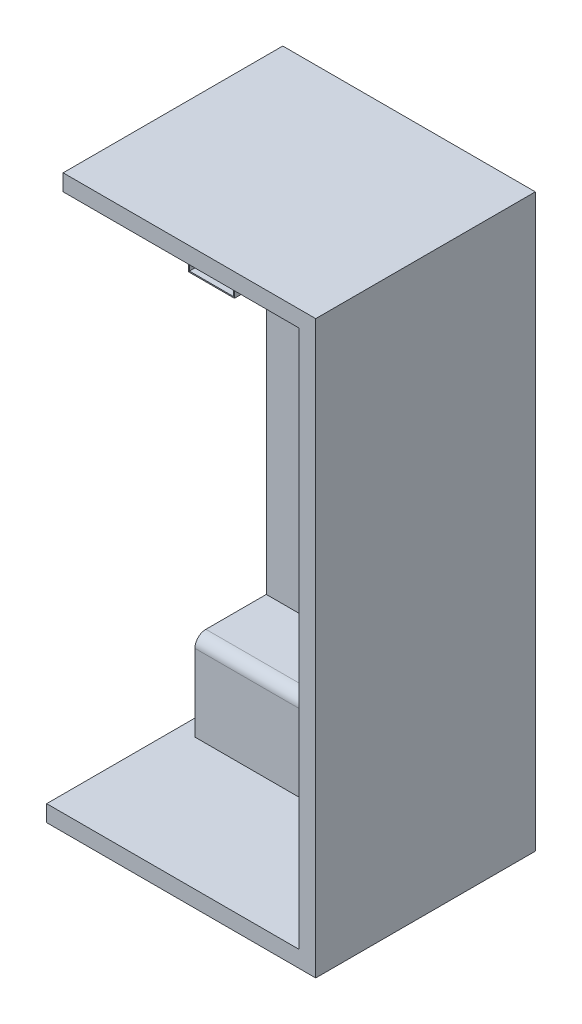
ISO-10303-21;
HEADER;
FILE_DESCRIPTION(('STEP AP214'),'2;1');
FILE_NAME('part.step','',(''),(''),'','','');
FILE_SCHEMA(('AUTOMOTIVE_DESIGN { 1 0 10303 214 1 1 1 1 }'));
ENDSEC;
DATA;
#1=APPLICATION_CONTEXT('core data for automotive mechanical design processes');
#2=APPLICATION_PROTOCOL_DEFINITION('international standard','automotive_design',2000,#1);
#3=PRODUCT_CONTEXT('',#1,'mechanical');
#4=PRODUCT('Part','Part','',(#3));
#5=PRODUCT_RELATED_PRODUCT_CATEGORY('part','',(#4));
#6=PRODUCT_DEFINITION_FORMATION('','',#4);
#7=PRODUCT_DEFINITION_CONTEXT('part definition',#1,'design');
#8=PRODUCT_DEFINITION('design','',#6,#7);
#9=PRODUCT_DEFINITION_SHAPE('','',#8);
#10=(LENGTH_UNIT() NAMED_UNIT(*) SI_UNIT(.MILLI.,.METRE.));
#11=(NAMED_UNIT(*) PLANE_ANGLE_UNIT() SI_UNIT($,.RADIAN.));
#12=(NAMED_UNIT(*) SI_UNIT($,.STERADIAN.) SOLID_ANGLE_UNIT());
#13=UNCERTAINTY_MEASURE_WITH_UNIT(LENGTH_MEASURE(1.E-05),#10,'distance_accuracy_value','');
#14=(GEOMETRIC_REPRESENTATION_CONTEXT(3) GLOBAL_UNCERTAINTY_ASSIGNED_CONTEXT((#13)) GLOBAL_UNIT_ASSIGNED_CONTEXT((#10,
#11,#12)) REPRESENTATION_CONTEXT('',''));
#15=CARTESIAN_POINT('',(0.,0.,0.));
#16=DIRECTION('',(0.,0.,1.));
#17=DIRECTION('',(1.,0.,0.));
#18=AXIS2_PLACEMENT_3D('',#15,#16,#17);
#19=CARTESIAN_POINT('',(-57.,492.,300.));
#20=DIRECTION('',(1.,0.,0.));
#21=DIRECTION('',(0.,1.,0.));
#22=AXIS2_PLACEMENT_3D('',#19,#20,#21);
#23=PLANE('',#22);
#24=DIRECTION('',(0.,-1.,0.));
#25=VECTOR('',#24,1.);
#26=CARTESIAN_POINT('',(-57.,408.,100.));
#27=LINE('',#26,#25);
#28=CARTESIAN_POINT('',(-57.,490.,100.));
#29=VERTEX_POINT('',#28);
#30=CARTESIAN_POINT('',(-57.,408.,100.));
#31=VERTEX_POINT('',#30);
#32=EDGE_CURVE('E173',#29,#31,#27,.T.);
#33=ORIENTED_EDGE('',*,*,#32,.T.);
#34=DIRECTION('',(0.,0.,-1.));
#35=VECTOR('',#34,1.);
#36=CARTESIAN_POINT('',(-57.,408.,300.));
#37=LINE('',#36,#35);
#38=CARTESIAN_POINT('',(-57.,408.,300.));
#39=VERTEX_POINT('',#38);
#40=EDGE_CURVE('E184',#39,#31,#37,.T.);
#41=ORIENTED_EDGE('',*,*,#40,.F.);
#42=DIRECTION('',(0.,-1.,0.));
#43=VECTOR('',#42,1.);
#44=CARTESIAN_POINT('',(-57.,492.,300.));
#45=LINE('',#44,#43);
#46=CARTESIAN_POINT('',(-57.,490.,300.));
#47=VERTEX_POINT('',#46);
#48=EDGE_CURVE('E348',#47,#39,#45,.T.);
#49=ORIENTED_EDGE('',*,*,#48,.F.);
#50=DIRECTION('',(0.,0.,1.));
#51=VECTOR('',#50,1.);
#52=CARTESIAN_POINT('',(-57.,490.,370.));
#53=LINE('',#52,#51);
#54=EDGE_CURVE('E47',#29,#47,#53,.T.);
#55=ORIENTED_EDGE('',*,*,#54,.F.);
#56=EDGE_LOOP('',(#33,#41,#49,#55));
#57=FACE_BOUND('',#56,.T.);
#58=ADVANCED_FACE('F32',(#57),#23,.F.);
#59=CARTESIAN_POINT('',(-57.,408.,300.));
#60=DIRECTION('',(0.,1.,0.));
#61=DIRECTION('',(0.,0.,1.));
#62=AXIS2_PLACEMENT_3D('',#59,#60,#61);
#63=PLANE('',#62);
#64=DIRECTION('',(1.,0.,0.));
#65=VECTOR('',#64,1.);
#66=CARTESIAN_POINT('',(-57.,408.,100.));
#67=LINE('',#66,#65);
#68=CARTESIAN_POINT('',(27.,408.,100.));
#69=VERTEX_POINT('',#68);
#70=EDGE_CURVE('E170',#31,#69,#67,.T.);
#71=ORIENTED_EDGE('',*,*,#70,.T.);
#72=DIRECTION('',(0.,0.,-1.));
#73=VECTOR('',#72,1.);
#74=CARTESIAN_POINT('',(27.,408.,300.));
#75=LINE('',#74,#73);
#76=CARTESIAN_POINT('',(27.,408.,300.));
#77=VERTEX_POINT('',#76);
#78=EDGE_CURVE('E190',#77,#69,#75,.T.);
#79=ORIENTED_EDGE('',*,*,#78,.F.);
#80=DIRECTION('',(1.,0.,0.));
#81=VECTOR('',#80,1.);
#82=CARTESIAN_POINT('',(-57.,408.,300.));
#83=LINE('',#82,#81);
#84=EDGE_CURVE('E188',#39,#77,#83,.T.);
#85=ORIENTED_EDGE('',*,*,#84,.F.);
#86=ORIENTED_EDGE('',*,*,#40,.T.);
#87=EDGE_LOOP('',(#71,#79,#85,#86));
#88=FACE_BOUND('',#87,.T.);
#89=ADVANCED_FACE('F187',(#88),#63,.F.);
#90=CARTESIAN_POINT('',(27.,492.,300.));
#91=DIRECTION('',(-1.,0.,0.));
#92=DIRECTION('',(0.,-1.,0.));
#93=AXIS2_PLACEMENT_3D('',#90,#91,#92);
#94=PLANE('',#93);
#95=DIRECTION('',(0.,1.,0.));
#96=VECTOR('',#95,1.);
#97=CARTESIAN_POINT('',(27.,408.,100.));
#98=LINE('',#97,#96);
#99=CARTESIAN_POINT('',(27.,490.,100.));
#100=VERTEX_POINT('',#99);
#101=EDGE_CURVE('E175',#69,#100,#98,.T.);
#102=ORIENTED_EDGE('',*,*,#101,.T.);
#103=DIRECTION('',(0.,0.,-1.));
#104=VECTOR('',#103,1.);
#105=CARTESIAN_POINT('',(27.,490.,370.));
#106=LINE('',#105,#104);
#107=CARTESIAN_POINT('',(27.,490.,300.));
#108=VERTEX_POINT('',#107);
#109=EDGE_CURVE('E317',#108,#100,#106,.T.);
#110=ORIENTED_EDGE('',*,*,#109,.F.);
#111=DIRECTION('',(0.,1.,0.));
#112=VECTOR('',#111,1.);
#113=CARTESIAN_POINT('',(27.,492.,300.));
#114=LINE('',#113,#112);
#115=EDGE_CURVE('E195',#77,#108,#114,.T.);
#116=ORIENTED_EDGE('',*,*,#115,.F.);
#117=ORIENTED_EDGE('',*,*,#78,.T.);
#118=EDGE_LOOP('',(#102,#110,#116,#117));
#119=FACE_BOUND('',#118,.T.);
#120=ADVANCED_FACE('F351',(#119),#94,.F.);
#121=CARTESIAN_POINT('',(-55.,490.,300.));
#122=DIRECTION('',(1.,0.,0.));
#123=DIRECTION('',(0.,1.,0.));
#124=AXIS2_PLACEMENT_3D('',#121,#122,#123);
#125=PLANE('',#124);
#126=DIRECTION('',(0.,0.,-1.));
#127=VECTOR('',#126,1.);
#128=CARTESIAN_POINT('',(-55.,410.,300.));
#129=LINE('',#128,#127);
#130=CARTESIAN_POINT('',(-55.,410.,300.));
#131=VERTEX_POINT('',#130);
#132=CARTESIAN_POINT('',(-55.,410.,100.));
#133=VERTEX_POINT('',#132);
#134=EDGE_CURVE('E345',#131,#133,#129,.T.);
#135=ORIENTED_EDGE('',*,*,#134,.T.);
#136=DIRECTION('',(0.,1.,0.));
#137=VECTOR('',#136,1.);
#138=CARTESIAN_POINT('',(-55.,490.,100.));
#139=LINE('',#138,#137);
#140=CARTESIAN_POINT('',(-55.,490.,100.));
#141=VERTEX_POINT('',#140);
#142=EDGE_CURVE('E359',#133,#141,#139,.T.);
#143=ORIENTED_EDGE('',*,*,#142,.T.);
#144=DIRECTION('',(0.,0.,-1.));
#145=VECTOR('',#144,1.);
#146=CARTESIAN_POINT('',(-55.,490.,300.));
#147=LINE('',#146,#145);
#148=CARTESIAN_POINT('',(-55.,490.,300.));
#149=VERTEX_POINT('',#148);
#150=EDGE_CURVE('E334',#149,#141,#147,.T.);
#151=ORIENTED_EDGE('',*,*,#150,.F.);
#152=DIRECTION('',(0.,-1.,0.));
#153=VECTOR('',#152,1.);
#154=CARTESIAN_POINT('',(-55.,490.,300.));
#155=LINE('',#154,#153);
#156=EDGE_CURVE('E339',#149,#131,#155,.T.);
#157=ORIENTED_EDGE('',*,*,#156,.T.);
#158=EDGE_LOOP('',(#135,#143,#151,#157));
#159=FACE_BOUND('',#158,.T.);
#160=ADVANCED_FACE('F368',(#159),#125,.T.);
#161=CARTESIAN_POINT('',(-55.,410.,300.));
#162=DIRECTION('',(0.,1.,0.));
#163=DIRECTION('',(0.,0.,1.));
#164=AXIS2_PLACEMENT_3D('',#161,#162,#163);
#165=PLANE('',#164);
#166=DIRECTION('',(0.,0.,-1.));
#167=VECTOR('',#166,1.);
#168=CARTESIAN_POINT('',(25.,410.,300.));
#169=LINE('',#168,#167);
#170=CARTESIAN_POINT('',(25.,410.,300.));
#171=VERTEX_POINT('',#170);
#172=CARTESIAN_POINT('',(25.,410.,100.));
#173=VERTEX_POINT('',#172);
#174=EDGE_CURVE('E333',#171,#173,#169,.T.);
#175=ORIENTED_EDGE('',*,*,#174,.T.);
#176=DIRECTION('',(-1.,0.,0.));
#177=VECTOR('',#176,1.);
#178=CARTESIAN_POINT('',(-55.,410.,100.));
#179=LINE('',#178,#177);
#180=EDGE_CURVE('E355',#173,#133,#179,.T.);
#181=ORIENTED_EDGE('',*,*,#180,.T.);
#182=ORIENTED_EDGE('',*,*,#134,.F.);
#183=DIRECTION('',(1.,0.,0.));
#184=VECTOR('',#183,1.);
#185=CARTESIAN_POINT('',(-55.,410.,300.));
#186=LINE('',#185,#184);
#187=EDGE_CURVE('E335',#131,#171,#186,.T.);
#188=ORIENTED_EDGE('',*,*,#187,.T.);
#189=EDGE_LOOP('',(#175,#181,#182,#188));
#190=FACE_BOUND('',#189,.T.);
#191=ADVANCED_FACE('F370',(#190),#165,.T.);
#192=CARTESIAN_POINT('',(25.,490.,300.));
#193=DIRECTION('',(-1.,0.,0.));
#194=DIRECTION('',(0.,-1.,0.));
#195=AXIS2_PLACEMENT_3D('',#192,#193,#194);
#196=PLANE('',#195);
#197=DIRECTION('',(0.,0.,-1.));
#198=VECTOR('',#197,1.);
#199=CARTESIAN_POINT('',(25.,490.,300.));
#200=LINE('',#199,#198);
#201=CARTESIAN_POINT('',(25.,490.,300.));
#202=VERTEX_POINT('',#201);
#203=CARTESIAN_POINT('',(25.,490.,100.));
#204=VERTEX_POINT('',#203);
#205=EDGE_CURVE('E331',#202,#204,#200,.T.);
#206=ORIENTED_EDGE('',*,*,#205,.T.);
#207=DIRECTION('',(0.,-1.,0.));
#208=VECTOR('',#207,1.);
#209=CARTESIAN_POINT('',(25.,490.,100.));
#210=LINE('',#209,#208);
#211=EDGE_CURVE('E11',#204,#173,#210,.T.);
#212=ORIENTED_EDGE('',*,*,#211,.T.);
#213=ORIENTED_EDGE('',*,*,#174,.F.);
#214=DIRECTION('',(0.,1.,0.));
#215=VECTOR('',#214,1.);
#216=CARTESIAN_POINT('',(25.,490.,300.));
#217=LINE('',#216,#215);
#218=EDGE_CURVE('E325',#171,#202,#217,.T.);
#219=ORIENTED_EDGE('',*,*,#218,.T.);
#220=EDGE_LOOP('',(#206,#212,#213,#219));
#221=FACE_BOUND('',#220,.T.);
#222=ADVANCED_FACE('F330',(#221),#196,.T.);
#223=CARTESIAN_POINT('',(215.,-490.,370.));
#224=DIRECTION('',(-1.,0.,0.));
#225=DIRECTION('',(0.,0.,1.));
#226=AXIS2_PLACEMENT_3D('',#223,#224,#225);
#227=PLANE('',#226);
#228=CARTESIAN_POINT('',(215.,-80.,160.000000000004));
#229=DIRECTION('',(-1.,0.,0.));
#230=DIRECTION('',(0.,0.,1.));
#231=AXIS2_PLACEMENT_3D('',#228,#229,#230);
#232=CIRCLE('',#231,2.99999999999999);
#233=CARTESIAN_POINT('',(215.,-80.,163.000000000004));
#234=VERTEX_POINT('',#233);
#235=EDGE_CURVE('E200',#234,#234,#232,.T.);
#236=ORIENTED_EDGE('',*,*,#235,.F.);
#237=EDGE_LOOP('',(#236));
#238=FACE_BOUND('',#237,.T.);
#239=CARTESIAN_POINT('',(215.,160.,160.000000000001));
#240=DIRECTION('',(-1.,0.,0.));
#241=DIRECTION('',(0.,0.,1.));
#242=AXIS2_PLACEMENT_3D('',#239,#240,#241);
#243=CIRCLE('',#242,2.99999999999999);
#244=CARTESIAN_POINT('',(215.,160.,163.000000000001));
#245=VERTEX_POINT('',#244);
#246=EDGE_CURVE('E211',#245,#245,#243,.T.);
#247=ORIENTED_EDGE('',*,*,#246,.F.);
#248=EDGE_LOOP('',(#247));
#249=FACE_BOUND('',#248,.T.);
#250=DIRECTION('',(0.,1.,0.));
#251=VECTOR('',#250,1.);
#252=CARTESIAN_POINT('',(215.,-490.,0.));
#253=LINE('',#252,#251);
#254=CARTESIAN_POINT('',(215.,-330.,0.));
#255=VERTEX_POINT('',#254);
#256=CARTESIAN_POINT('',(215.,490.,0.));
#257=VERTEX_POINT('',#256);
#258=EDGE_CURVE('E268',#255,#257,#253,.T.);
#259=ORIENTED_EDGE('',*,*,#258,.F.);
#260=DIRECTION('',(0.,0.,-1.));
#261=VECTOR('',#260,1.);
#262=CARTESIAN_POINT('',(215.,-330.,130.));
#263=LINE('',#262,#261);
#264=CARTESIAN_POINT('',(215.,-330.,110.));
#265=VERTEX_POINT('',#264);
#266=EDGE_CURVE('E255',#265,#255,#263,.T.);
#267=ORIENTED_EDGE('',*,*,#266,.F.);
#268=CARTESIAN_POINT('',(215.,-350.,110.));
#269=DIRECTION('',(-1.,0.,0.));
#270=DIRECTION('',(0.,0.,1.));
#271=AXIS2_PLACEMENT_3D('',#268,#269,#270);
#272=CIRCLE('',#271,20.);
#273=CARTESIAN_POINT('',(215.,-350.,130.));
#274=VERTEX_POINT('',#273);
#275=EDGE_CURVE('E315',#265,#274,#272,.F.);
#276=ORIENTED_EDGE('',*,*,#275,.T.);
#277=DIRECTION('',(0.,1.,0.));
#278=VECTOR('',#277,1.);
#279=CARTESIAN_POINT('',(215.,-490.,130.));
#280=LINE('',#279,#278);
#281=CARTESIAN_POINT('',(215.,-490.,130.));
#282=VERTEX_POINT('',#281);
#283=EDGE_CURVE('E248',#282,#274,#280,.T.);
#284=ORIENTED_EDGE('',*,*,#283,.F.);
#285=DIRECTION('',(0.,0.,-1.));
#286=VECTOR('',#285,1.);
#287=CARTESIAN_POINT('',(215.,-490.,370.));
#288=LINE('',#287,#286);
#289=CARTESIAN_POINT('',(215.,-490.,370.));
#290=VERTEX_POINT('',#289);
#291=EDGE_CURVE('E277',#290,#282,#288,.T.);
#292=ORIENTED_EDGE('',*,*,#291,.F.);
#293=DIRECTION('',(0.,1.,0.));
#294=VECTOR('',#293,1.);
#295=CARTESIAN_POINT('',(215.,-490.,370.));
#296=LINE('',#295,#294);
#297=CARTESIAN_POINT('',(215.,490.,370.));
#298=VERTEX_POINT('',#297);
#299=EDGE_CURVE('E269',#290,#298,#296,.T.);
#300=ORIENTED_EDGE('',*,*,#299,.T.);
#301=DIRECTION('',(0.,0.,-1.));
#302=VECTOR('',#301,1.);
#303=CARTESIAN_POINT('',(215.,490.,370.));
#304=LINE('',#303,#302);
#305=EDGE_CURVE('E288',#298,#257,#304,.T.);
#306=ORIENTED_EDGE('',*,*,#305,.T.);
#307=EDGE_LOOP('',(#259,#267,#276,#284,#292,#300,#306));
#308=FACE_BOUND('',#307,.T.);
#309=CARTESIAN_POINT('',(215.,280.,160.));
#310=DIRECTION('',(-1.,0.,0.));
#311=DIRECTION('',(0.,0.,1.));
#312=AXIS2_PLACEMENT_3D('',#309,#310,#311);
#313=CIRCLE('',#312,2.99999999999999);
#314=CARTESIAN_POINT('',(215.,280.,163.));
#315=VERTEX_POINT('',#314);
#316=EDGE_CURVE('E217',#315,#315,#313,.T.);
#317=ORIENTED_EDGE('',*,*,#316,.F.);
#318=EDGE_LOOP('',(#317));
#319=FACE_BOUND('',#318,.T.);
#320=CARTESIAN_POINT('',(215.,40.,160.000000000003));
#321=DIRECTION('',(-1.,0.,0.));
#322=DIRECTION('',(0.,0.,1.));
#323=AXIS2_PLACEMENT_3D('',#320,#321,#322);
#324=CIRCLE('',#323,2.99999999999999);
#325=CARTESIAN_POINT('',(215.,40.,163.000000000003));
#326=VERTEX_POINT('',#325);
#327=EDGE_CURVE('E205',#326,#326,#324,.T.);
#328=ORIENTED_EDGE('',*,*,#327,.F.);
#329=EDGE_LOOP('',(#328));
#330=FACE_BOUND('',#329,.T.);
#331=CARTESIAN_POINT('',(215.,-200.,160.000000000005));
#332=DIRECTION('',(-1.,0.,0.));
#333=DIRECTION('',(0.,0.,1.));
#334=AXIS2_PLACEMENT_3D('',#331,#332,#333);
#335=CIRCLE('',#334,2.99999999999999);
#336=CARTESIAN_POINT('',(215.,-200.,163.000000000005));
#337=VERTEX_POINT('',#336);
#338=EDGE_CURVE('E189',#337,#337,#335,.T.);
#339=ORIENTED_EDGE('',*,*,#338,.F.);
#340=EDGE_LOOP('',(#339));
#341=FACE_BOUND('',#340,.T.);
#342=ADVANCED_FACE('F407',(#238,#249,#308,#319,#330,#341),#227,.T.);
#343=CARTESIAN_POINT('',(-215.,-490.,370.));
#344=DIRECTION('',(0.,1.,0.));
#345=DIRECTION('',(0.,0.,1.));
#346=AXIS2_PLACEMENT_3D('',#343,#344,#345);
#347=PLANE('',#346);
#348=ORIENTED_EDGE('',*,*,#291,.T.);
#349=DIRECTION('',(1.,0.,0.));
#350=VECTOR('',#349,1.);
#351=CARTESIAN_POINT('',(-215.,-490.,130.));
#352=LINE('',#351,#350);
#353=CARTESIAN_POINT('',(-215.,-490.,130.));
#354=VERTEX_POINT('',#353);
#355=EDGE_CURVE('E245',#354,#282,#352,.T.);
#356=ORIENTED_EDGE('',*,*,#355,.F.);
#357=DIRECTION('',(0.,0.,1.));
#358=VECTOR('',#357,1.);
#359=CARTESIAN_POINT('',(-215.,-490.,-1040.44544632553));
#360=LINE('',#359,#358);
#361=CARTESIAN_POINT('',(-215.,-490.,-30.));
#362=VERTEX_POINT('',#361);
#363=EDGE_CURVE('E230',#362,#354,#360,.T.);
#364=ORIENTED_EDGE('',*,*,#363,.F.);
#365=DIRECTION('',(1.,0.,0.));
#366=VECTOR('',#365,1.);
#367=CARTESIAN_POINT('',(-245.,-490.,-30.));
#368=LINE('',#367,#366);
#369=CARTESIAN_POINT('',(-245.,-490.,-30.));
#370=VERTEX_POINT('',#369);
#371=EDGE_CURVE('E227',#370,#362,#368,.T.);
#372=ORIENTED_EDGE('',*,*,#371,.F.);
#373=DIRECTION('',(0.,0.,1.));
#374=VECTOR('',#373,1.);
#375=CARTESIAN_POINT('',(-245.,-490.,-1040.44544632553));
#376=LINE('',#375,#374);
#377=CARTESIAN_POINT('',(-245.,-490.,370.));
#378=VERTEX_POINT('',#377);
#379=EDGE_CURVE('E237',#370,#378,#376,.T.);
#380=ORIENTED_EDGE('',*,*,#379,.T.);
#381=DIRECTION('',(1.,0.,0.));
#382=VECTOR('',#381,1.);
#383=CARTESIAN_POINT('',(-215.,-490.,370.));
#384=LINE('',#383,#382);
#385=EDGE_CURVE('E275',#378,#290,#384,.T.);
#386=ORIENTED_EDGE('',*,*,#385,.T.);
#387=EDGE_LOOP('',(#348,#356,#364,#372,#380,#386));
#388=FACE_BOUND('',#387,.T.);
#389=ADVANCED_FACE('F397',(#388),#347,.T.);
#390=CARTESIAN_POINT('',(0.,0.,0.));
#391=DIRECTION('',(0.,0.,-1.));
#392=DIRECTION('',(-1.,0.,0.));
#393=AXIS2_PLACEMENT_3D('',#390,#391,#392);
#394=PLANE('',#393);
#395=DIRECTION('',(-1.,0.,0.));
#396=VECTOR('',#395,1.);
#397=CARTESIAN_POINT('',(-215.,490.,0.));
#398=LINE('',#397,#396);
#399=CARTESIAN_POINT('',(-215.,490.,0.));
#400=VERTEX_POINT('',#399);
#401=EDGE_CURVE('E279',#257,#400,#398,.T.);
#402=ORIENTED_EDGE('',*,*,#401,.T.);
#403=DIRECTION('',(0.,-1.,0.));
#404=VECTOR('',#403,1.);
#405=CARTESIAN_POINT('',(-215.,-490.,0.));
#406=LINE('',#405,#404);
#407=CARTESIAN_POINT('',(-215.,-330.,0.));
#408=VERTEX_POINT('',#407);
#409=EDGE_CURVE('E272',#400,#408,#406,.T.);
#410=ORIENTED_EDGE('',*,*,#409,.T.);
#411=DIRECTION('',(-1.,0.,0.));
#412=VECTOR('',#411,1.);
#413=CARTESIAN_POINT('',(-215.,-330.,0.));
#414=LINE('',#413,#412);
#415=EDGE_CURVE('E241',#255,#408,#414,.T.);
#416=ORIENTED_EDGE('',*,*,#415,.F.);
#417=ORIENTED_EDGE('',*,*,#258,.T.);
#418=EDGE_LOOP('',(#402,#410,#416,#417));
#419=FACE_BOUND('',#418,.T.);
#420=ADVANCED_FACE('F422',(#419),#394,.F.);
#421=CARTESIAN_POINT('',(0.,0.,370.));
#422=DIRECTION('',(0.,0.,1.));
#423=DIRECTION('',(1.,0.,0.));
#424=AXIS2_PLACEMENT_3D('',#421,#422,#423);
#425=PLANE('',#424);
#426=ORIENTED_EDGE('',*,*,#385,.F.);
#427=DIRECTION('',(0.,-1.,0.));
#428=VECTOR('',#427,1.);
#429=CARTESIAN_POINT('',(-245.,-520.,370.));
#430=LINE('',#429,#428);
#431=CARTESIAN_POINT('',(-245.,-520.,370.));
#432=VERTEX_POINT('',#431);
#433=EDGE_CURVE('E299',#378,#432,#430,.T.);
#434=ORIENTED_EDGE('',*,*,#433,.T.);
#435=DIRECTION('',(1.,0.,0.));
#436=VECTOR('',#435,1.);
#437=CARTESIAN_POINT('',(-245.,-520.,370.));
#438=LINE('',#437,#436);
#439=CARTESIAN_POINT('',(245.,-520.,370.));
#440=VERTEX_POINT('',#439);
#441=EDGE_CURVE('E291',#432,#440,#438,.T.);
#442=ORIENTED_EDGE('',*,*,#441,.T.);
#443=DIRECTION('',(0.,1.,0.));
#444=VECTOR('',#443,1.);
#445=CARTESIAN_POINT('',(245.,-520.,370.));
#446=LINE('',#445,#444);
#447=CARTESIAN_POINT('',(245.,520.,370.));
#448=VERTEX_POINT('',#447);
#449=EDGE_CURVE('E294',#440,#448,#446,.T.);
#450=ORIENTED_EDGE('',*,*,#449,.T.);
#451=DIRECTION('',(-1.,0.,0.));
#452=VECTOR('',#451,1.);
#453=CARTESIAN_POINT('',(-245.,520.,370.));
#454=LINE('',#453,#452);
#455=CARTESIAN_POINT('',(-215.,520.,370.));
#456=VERTEX_POINT('',#455);
#457=EDGE_CURVE('E296',#448,#456,#454,.T.);
#458=ORIENTED_EDGE('',*,*,#457,.T.);
#459=DIRECTION('',(0.,1.,0.));
#460=VECTOR('',#459,1.);
#461=CARTESIAN_POINT('',(-215.,520.,370.));
#462=LINE('',#461,#460);
#463=CARTESIAN_POINT('',(-215.,490.,370.));
#464=VERTEX_POINT('',#463);
#465=EDGE_CURVE('E223',#464,#456,#462,.T.);
#466=ORIENTED_EDGE('',*,*,#465,.F.);
#467=DIRECTION('',(-1.,0.,0.));
#468=VECTOR('',#467,1.);
#469=CARTESIAN_POINT('',(-215.,490.,370.));
#470=LINE('',#469,#468);
#471=EDGE_CURVE('E271',#298,#464,#470,.T.);
#472=ORIENTED_EDGE('',*,*,#471,.F.);
#473=ORIENTED_EDGE('',*,*,#299,.F.);
#474=EDGE_LOOP('',(#426,#434,#442,#450,#458,#466,#472,#473));
#475=FACE_BOUND('',#474,.T.);
#476=ADVANCED_FACE('F384',(#475),#425,.T.);
#477=CARTESIAN_POINT('',(-245.,-520.,370.));
#478=DIRECTION('',(0.,1.,0.));
#479=DIRECTION('',(0.,0.,1.));
#480=AXIS2_PLACEMENT_3D('',#477,#478,#479);
#481=PLANE('',#480);
#482=DIRECTION('',(0.,0.,-1.));
#483=VECTOR('',#482,1.);
#484=CARTESIAN_POINT('',(-245.,-520.,370.));
#485=LINE('',#484,#483);
#486=CARTESIAN_POINT('',(-245.,-520.,-30.));
#487=VERTEX_POINT('',#486);
#488=EDGE_CURVE('E301',#432,#487,#485,.T.);
#489=ORIENTED_EDGE('',*,*,#488,.T.);
#490=DIRECTION('',(-1.,0.,0.));
#491=VECTOR('',#490,1.);
#492=CARTESIAN_POINT('',(245.,-520.,-30.));
#493=LINE('',#492,#491);
#494=CARTESIAN_POINT('',(245.,-520.,-30.));
#495=VERTEX_POINT('',#494);
#496=EDGE_CURVE('E260',#495,#487,#493,.T.);
#497=ORIENTED_EDGE('',*,*,#496,.F.);
#498=DIRECTION('',(0.,0.,-1.));
#499=VECTOR('',#498,1.);
#500=CARTESIAN_POINT('',(245.,-520.,370.));
#501=LINE('',#500,#499);
#502=EDGE_CURVE('E306',#440,#495,#501,.T.);
#503=ORIENTED_EDGE('',*,*,#502,.F.);
#504=ORIENTED_EDGE('',*,*,#441,.F.);
#505=EDGE_LOOP('',(#489,#497,#503,#504));
#506=FACE_BOUND('',#505,.T.);
#507=ADVANCED_FACE('F429',(#506),#481,.F.);
#508=CARTESIAN_POINT('',(245.,-520.,370.));
#509=DIRECTION('',(-1.,0.,0.));
#510=DIRECTION('',(0.,0.,1.));
#511=AXIS2_PLACEMENT_3D('',#508,#509,#510);
#512=PLANE('',#511);
#513=ORIENTED_EDGE('',*,*,#502,.T.);
#514=DIRECTION('',(0.,-1.,0.));
#515=VECTOR('',#514,1.);
#516=CARTESIAN_POINT('',(245.,520.,-30.));
#517=LINE('',#516,#515);
#518=CARTESIAN_POINT('',(245.,520.,-30.));
#519=VERTEX_POINT('',#518);
#520=EDGE_CURVE('E257',#519,#495,#517,.T.);
#521=ORIENTED_EDGE('',*,*,#520,.F.);
#522=DIRECTION('',(0.,0.,-1.));
#523=VECTOR('',#522,1.);
#524=CARTESIAN_POINT('',(245.,520.,370.));
#525=LINE('',#524,#523);
#526=EDGE_CURVE('E303',#448,#519,#525,.T.);
#527=ORIENTED_EDGE('',*,*,#526,.F.);
#528=ORIENTED_EDGE('',*,*,#449,.F.);
#529=EDGE_LOOP('',(#513,#521,#527,#528));
#530=FACE_BOUND('',#529,.T.);
#531=ADVANCED_FACE('F633',(#530),#512,.F.);
#532=CARTESIAN_POINT('',(-245.,520.,370.));
#533=DIRECTION('',(0.,-1.,0.));
#534=DIRECTION('',(0.,0.,-1.));
#535=AXIS2_PLACEMENT_3D('',#532,#533,#534);
#536=PLANE('',#535);
#537=DIRECTION('',(1.,0.,0.));
#538=VECTOR('',#537,1.);
#539=CARTESIAN_POINT('',(245.,520.,-30.));
#540=LINE('',#539,#538);
#541=CARTESIAN_POINT('',(-215.,520.,-30.));
#542=VERTEX_POINT('',#541);
#543=EDGE_CURVE('E266',#542,#519,#540,.T.);
#544=ORIENTED_EDGE('',*,*,#543,.F.);
#545=DIRECTION('',(0.,0.,1.));
#546=VECTOR('',#545,1.);
#547=CARTESIAN_POINT('',(-215.,520.,-1040.44544632553));
#548=LINE('',#547,#546);
#549=EDGE_CURVE('E234',#542,#456,#548,.T.);
#550=ORIENTED_EDGE('',*,*,#549,.T.);
#551=ORIENTED_EDGE('',*,*,#457,.F.);
#552=ORIENTED_EDGE('',*,*,#526,.T.);
#553=EDGE_LOOP('',(#544,#550,#551,#552));
#554=FACE_BOUND('',#553,.T.);
#555=ADVANCED_FACE('F390',(#554),#536,.F.);
#556=CARTESIAN_POINT('',(-245.,-520.,370.));
#557=DIRECTION('',(1.,0.,0.));
#558=DIRECTION('',(0.,0.,-1.));
#559=AXIS2_PLACEMENT_3D('',#556,#557,#558);
#560=PLANE('',#559);
#561=ORIENTED_EDGE('',*,*,#433,.F.);
#562=ORIENTED_EDGE('',*,*,#379,.F.);
#563=DIRECTION('',(0.,1.,0.));
#564=VECTOR('',#563,1.);
#565=CARTESIAN_POINT('',(-245.,520.,-30.));
#566=LINE('',#565,#564);
#567=EDGE_CURVE('E263',#487,#370,#566,.T.);
#568=ORIENTED_EDGE('',*,*,#567,.F.);
#569=ORIENTED_EDGE('',*,*,#488,.F.);
#570=EDGE_LOOP('',(#561,#562,#568,#569));
#571=FACE_BOUND('',#570,.T.);
#572=ADVANCED_FACE('F374',(#571),#560,.F.);
#573=CARTESIAN_POINT('',(-215.,490.,370.));
#574=DIRECTION('',(0.,-1.,0.));
#575=DIRECTION('',(0.,0.,-1.));
#576=AXIS2_PLACEMENT_3D('',#573,#574,#575);
#577=PLANE('',#576);
#578=DIRECTION('',(-1.,0.,0.));
#579=VECTOR('',#578,1.);
#580=CARTESIAN_POINT('',(-57.,490.,100.));
#581=LINE('',#580,#579);
#582=EDGE_CURVE('E354',#100,#204,#581,.T.);
#583=ORIENTED_EDGE('',*,*,#582,.T.);
#584=ORIENTED_EDGE('',*,*,#205,.F.);
#585=DIRECTION('',(-1.,0.,0.));
#586=VECTOR('',#585,1.);
#587=CARTESIAN_POINT('',(-215.,490.,300.));
#588=LINE('',#587,#586);
#589=EDGE_CURVE('E55',#108,#202,#588,.T.);
#590=ORIENTED_EDGE('',*,*,#589,.F.);
#591=ORIENTED_EDGE('',*,*,#109,.T.);
#592=EDGE_LOOP('',(#583,#584,#590,#591));
#593=FACE_BOUND('',#592,.T.);
#594=EDGE_CURVE('E356',#141,#29,#581,.T.);
#595=ORIENTED_EDGE('',*,*,#594,.T.);
#596=ORIENTED_EDGE('',*,*,#54,.T.);
#597=EDGE_CURVE('E40',#149,#47,#588,.T.);
#598=ORIENTED_EDGE('',*,*,#597,.F.);
#599=ORIENTED_EDGE('',*,*,#150,.T.);
#600=EDGE_LOOP('',(#595,#596,#598,#599));
#601=FACE_BOUND('',#600,.T.);
#602=DIRECTION('',(0.,0.,-1.));
#603=VECTOR('',#602,1.);
#604=CARTESIAN_POINT('',(-215.,490.,370.));
#605=LINE('',#604,#603);
#606=EDGE_CURVE('E285',#464,#400,#605,.T.);
#607=ORIENTED_EDGE('',*,*,#606,.T.);
#608=ORIENTED_EDGE('',*,*,#401,.F.);
#609=ORIENTED_EDGE('',*,*,#305,.F.);
#610=ORIENTED_EDGE('',*,*,#471,.T.);
#611=EDGE_LOOP('',(#607,#608,#609,#610));
#612=FACE_BOUND('',#611,.T.);
#613=ADVANCED_FACE('F353',(#593,#601,#612),#577,.T.);
#614=CARTESIAN_POINT('',(0.,0.,-30.));
#615=DIRECTION('',(0.,0.,-1.));
#616=DIRECTION('',(-1.,0.,0.));
#617=AXIS2_PLACEMENT_3D('',#614,#615,#616);
#618=PLANE('',#617);
#619=ORIENTED_EDGE('',*,*,#371,.T.);
#620=DIRECTION('',(0.,1.,0.));
#621=VECTOR('',#620,1.);
#622=CARTESIAN_POINT('',(-215.,520.,-30.));
#623=LINE('',#622,#621);
#624=EDGE_CURVE('E231',#362,#542,#623,.T.);
#625=ORIENTED_EDGE('',*,*,#624,.T.);
#626=ORIENTED_EDGE('',*,*,#543,.T.);
#627=ORIENTED_EDGE('',*,*,#520,.T.);
#628=ORIENTED_EDGE('',*,*,#496,.T.);
#629=ORIENTED_EDGE('',*,*,#567,.T.);
#630=EDGE_LOOP('',(#619,#625,#626,#627,#628,#629));
#631=FACE_BOUND('',#630,.T.);
#632=ADVANCED_FACE('F373',(#631),#618,.T.);
#633=CARTESIAN_POINT('',(-215.,-330.,130.));
#634=DIRECTION('',(0.,-1.,0.));
#635=DIRECTION('',(0.,0.,-1.));
#636=AXIS2_PLACEMENT_3D('',#633,#634,#635);
#637=PLANE('',#636);
#638=DIRECTION('',(0.,0.,-1.));
#639=VECTOR('',#638,1.);
#640=CARTESIAN_POINT('',(-215.,-330.,130.));
#641=LINE('',#640,#639);
#642=CARTESIAN_POINT('',(-215.,-330.,110.));
#643=VERTEX_POINT('',#642);
#644=EDGE_CURVE('E251',#643,#408,#641,.T.);
#645=ORIENTED_EDGE('',*,*,#644,.F.);
#646=DIRECTION('',(-1.,0.,0.));
#647=VECTOR('',#646,1.);
#648=CARTESIAN_POINT('',(-215.,-330.,110.));
#649=LINE('',#648,#647);
#650=EDGE_CURVE('E311',#643,#265,#649,.F.);
#651=ORIENTED_EDGE('',*,*,#650,.T.);
#652=ORIENTED_EDGE('',*,*,#266,.T.);
#653=ORIENTED_EDGE('',*,*,#415,.T.);
#654=EDGE_LOOP('',(#645,#651,#652,#653));
#655=FACE_BOUND('',#654,.T.);
#656=ADVANCED_FACE('F419',(#655),#637,.F.);
#657=CARTESIAN_POINT('',(0.,0.,130.));
#658=DIRECTION('',(0.,0.,-1.));
#659=DIRECTION('',(-1.,0.,0.));
#660=AXIS2_PLACEMENT_3D('',#657,#658,#659);
#661=PLANE('',#660);
#662=ORIENTED_EDGE('',*,*,#283,.T.);
#663=DIRECTION('',(-1.,0.,0.));
#664=VECTOR('',#663,1.);
#665=CARTESIAN_POINT('',(0.,-350.,130.));
#666=LINE('',#665,#664);
#667=CARTESIAN_POINT('',(-215.,-350.,130.));
#668=VERTEX_POINT('',#667);
#669=EDGE_CURVE('E308',#274,#668,#666,.T.);
#670=ORIENTED_EDGE('',*,*,#669,.T.);
#671=DIRECTION('',(0.,-1.,0.));
#672=VECTOR('',#671,1.);
#673=CARTESIAN_POINT('',(-215.,-490.,130.));
#674=LINE('',#673,#672);
#675=EDGE_CURVE('E242',#668,#354,#674,.T.);
#676=ORIENTED_EDGE('',*,*,#675,.T.);
#677=ORIENTED_EDGE('',*,*,#355,.T.);
#678=EDGE_LOOP('',(#662,#670,#676,#677));
#679=FACE_BOUND('',#678,.T.);
#680=ADVANCED_FACE('F413',(#679),#661,.F.);
#681=CARTESIAN_POINT('',(0.,-350.,110.));
#682=DIRECTION('',(-1.,0.,0.));
#683=DIRECTION('',(0.,0.,1.));
#684=AXIS2_PLACEMENT_3D('',#681,#682,#683);
#685=CYLINDRICAL_SURFACE('',#684,20.);
#686=ORIENTED_EDGE('',*,*,#275,.F.);
#687=ORIENTED_EDGE('',*,*,#650,.F.);
#688=CARTESIAN_POINT('',(-215.,-350.,110.));
#689=DIRECTION('',(1.,0.,0.));
#690=DIRECTION('',(0.,0.,-1.));
#691=AXIS2_PLACEMENT_3D('',#688,#689,#690);
#692=CIRCLE('',#691,20.);
#693=EDGE_CURVE('E313',#668,#643,#692,.F.);
#694=ORIENTED_EDGE('',*,*,#693,.F.);
#695=ORIENTED_EDGE('',*,*,#669,.F.);
#696=EDGE_LOOP('',(#686,#687,#694,#695));
#697=FACE_BOUND('',#696,.T.);
#698=ADVANCED_FACE('F34',(#697),#685,.T.);
#699=CARTESIAN_POINT('',(-215.,520.,-1040.44544632553));
#700=DIRECTION('',(1.,0.,0.));
#701=DIRECTION('',(0.,0.,-1.));
#702=AXIS2_PLACEMENT_3D('',#699,#700,#701);
#703=PLANE('',#702);
#704=ORIENTED_EDGE('',*,*,#606,.F.);
#705=ORIENTED_EDGE('',*,*,#465,.T.);
#706=ORIENTED_EDGE('',*,*,#549,.F.);
#707=ORIENTED_EDGE('',*,*,#624,.F.);
#708=ORIENTED_EDGE('',*,*,#363,.T.);
#709=ORIENTED_EDGE('',*,*,#675,.F.);
#710=ORIENTED_EDGE('',*,*,#693,.T.);
#711=ORIENTED_EDGE('',*,*,#644,.T.);
#712=ORIENTED_EDGE('',*,*,#409,.F.);
#713=EDGE_LOOP('',(#704,#705,#706,#707,#708,#709,#710,#711,#712));
#714=FACE_BOUND('',#713,.T.);
#715=ADVANCED_FACE('F382',(#714),#703,.F.);
#716=CARTESIAN_POINT('',(165.,280.,160.));
#717=DIRECTION('',(1.,0.,0.));
#718=DIRECTION('',(0.,0.,-1.));
#719=AXIS2_PLACEMENT_3D('',#716,#717,#718);
#720=CYLINDRICAL_SURFACE('',#719,2.99999999999999);
#721=CARTESIAN_POINT('',(165.,280.,160.));
#722=DIRECTION('',(-1.,0.,0.));
#723=DIRECTION('',(0.,0.,1.));
#724=AXIS2_PLACEMENT_3D('',#721,#722,#723);
#725=CIRCLE('',#724,2.99999999999999);
#726=CARTESIAN_POINT('',(165.,280.,163.));
#727=VERTEX_POINT('',#726);
#728=EDGE_CURVE('E220',#727,#727,#725,.T.);
#729=ORIENTED_EDGE('',*,*,#728,.F.);
#730=EDGE_LOOP('',(#729));
#731=FACE_BOUND('',#730,.T.);
#732=ORIENTED_EDGE('',*,*,#316,.T.);
#733=EDGE_LOOP('',(#732));
#734=FACE_BOUND('',#733,.T.);
#735=ADVANCED_FACE('F476',(#731,#734),#720,.T.);
#736=CARTESIAN_POINT('',(165.,280.,160.));
#737=DIRECTION('',(-1.,0.,0.));
#738=DIRECTION('',(0.,0.,1.));
#739=AXIS2_PLACEMENT_3D('',#736,#737,#738);
#740=PLANE('',#739);
#741=ORIENTED_EDGE('',*,*,#728,.T.);
#742=EDGE_LOOP('',(#741));
#743=FACE_BOUND('',#742,.T.);
#744=ADVANCED_FACE('F472',(#743),#740,.T.);
#745=CARTESIAN_POINT('',(165.,160.,160.000000000001));
#746=DIRECTION('',(1.,0.,0.));
#747=DIRECTION('',(0.,0.,-1.));
#748=AXIS2_PLACEMENT_3D('',#745,#746,#747);
#749=CYLINDRICAL_SURFACE('',#748,2.99999999999999);
#750=CARTESIAN_POINT('',(165.,160.,160.000000000001));
#751=DIRECTION('',(-1.,0.,0.));
#752=DIRECTION('',(0.,0.,1.));
#753=AXIS2_PLACEMENT_3D('',#750,#751,#752);
#754=CIRCLE('',#753,2.99999999999999);
#755=CARTESIAN_POINT('',(165.,160.,163.000000000001));
#756=VERTEX_POINT('',#755);
#757=EDGE_CURVE('E214',#756,#756,#754,.T.);
#758=ORIENTED_EDGE('',*,*,#757,.F.);
#759=EDGE_LOOP('',(#758));
#760=FACE_BOUND('',#759,.T.);
#761=ORIENTED_EDGE('',*,*,#246,.T.);
#762=EDGE_LOOP('',(#761));
#763=FACE_BOUND('',#762,.T.);
#764=ADVANCED_FACE('F468',(#760,#763),#749,.T.);
#765=CARTESIAN_POINT('',(165.,160.,160.000000000001));
#766=DIRECTION('',(-1.,0.,0.));
#767=DIRECTION('',(0.,0.,1.));
#768=AXIS2_PLACEMENT_3D('',#765,#766,#767);
#769=PLANE('',#768);
#770=ORIENTED_EDGE('',*,*,#757,.T.);
#771=EDGE_LOOP('',(#770));
#772=FACE_BOUND('',#771,.T.);
#773=ADVANCED_FACE('F464',(#772),#769,.T.);
#774=CARTESIAN_POINT('',(165.,40.,160.000000000003));
#775=DIRECTION('',(1.,0.,0.));
#776=DIRECTION('',(0.,0.,-1.));
#777=AXIS2_PLACEMENT_3D('',#774,#775,#776);
#778=CYLINDRICAL_SURFACE('',#777,2.99999999999999);
#779=CARTESIAN_POINT('',(165.,40.,160.000000000003));
#780=DIRECTION('',(-1.,0.,0.));
#781=DIRECTION('',(0.,0.,1.));
#782=AXIS2_PLACEMENT_3D('',#779,#780,#781);
#783=CIRCLE('',#782,2.99999999999999);
#784=CARTESIAN_POINT('',(165.,40.,163.000000000003));
#785=VERTEX_POINT('',#784);
#786=EDGE_CURVE('E208',#785,#785,#783,.T.);
#787=ORIENTED_EDGE('',*,*,#786,.F.);
#788=EDGE_LOOP('',(#787));
#789=FACE_BOUND('',#788,.T.);
#790=ORIENTED_EDGE('',*,*,#327,.T.);
#791=EDGE_LOOP('',(#790));
#792=FACE_BOUND('',#791,.T.);
#793=ADVANCED_FACE('F460',(#789,#792),#778,.T.);
#794=CARTESIAN_POINT('',(165.,40.,160.000000000003));
#795=DIRECTION('',(-1.,0.,0.));
#796=DIRECTION('',(0.,0.,1.));
#797=AXIS2_PLACEMENT_3D('',#794,#795,#796);
#798=PLANE('',#797);
#799=ORIENTED_EDGE('',*,*,#786,.T.);
#800=EDGE_LOOP('',(#799));
#801=FACE_BOUND('',#800,.T.);
#802=ADVANCED_FACE('F456',(#801),#798,.T.);
#803=CARTESIAN_POINT('',(165.,-80.,160.000000000004));
#804=DIRECTION('',(1.,0.,0.));
#805=DIRECTION('',(0.,0.,-1.));
#806=AXIS2_PLACEMENT_3D('',#803,#804,#805);
#807=CYLINDRICAL_SURFACE('',#806,2.99999999999999);
#808=CARTESIAN_POINT('',(165.,-80.,160.000000000004));
#809=DIRECTION('',(-1.,0.,0.));
#810=DIRECTION('',(0.,0.,1.));
#811=AXIS2_PLACEMENT_3D('',#808,#809,#810);
#812=CIRCLE('',#811,2.99999999999999);
#813=CARTESIAN_POINT('',(165.,-80.,163.000000000004));
#814=VERTEX_POINT('',#813);
#815=EDGE_CURVE('E202',#814,#814,#812,.T.);
#816=ORIENTED_EDGE('',*,*,#815,.F.);
#817=EDGE_LOOP('',(#816));
#818=FACE_BOUND('',#817,.T.);
#819=ORIENTED_EDGE('',*,*,#235,.T.);
#820=EDGE_LOOP('',(#819));
#821=FACE_BOUND('',#820,.T.);
#822=ADVANCED_FACE('F452',(#818,#821),#807,.T.);
#823=CARTESIAN_POINT('',(165.,-80.,160.000000000004));
#824=DIRECTION('',(-1.,0.,0.));
#825=DIRECTION('',(0.,0.,1.));
#826=AXIS2_PLACEMENT_3D('',#823,#824,#825);
#827=PLANE('',#826);
#828=ORIENTED_EDGE('',*,*,#815,.T.);
#829=EDGE_LOOP('',(#828));
#830=FACE_BOUND('',#829,.T.);
#831=ADVANCED_FACE('F448',(#830),#827,.T.);
#832=CARTESIAN_POINT('',(165.,-200.,160.000000000005));
#833=DIRECTION('',(1.,0.,0.));
#834=DIRECTION('',(0.,0.,-1.));
#835=AXIS2_PLACEMENT_3D('',#832,#833,#834);
#836=CYLINDRICAL_SURFACE('',#835,2.99999999999999);
#837=CARTESIAN_POINT('',(165.,-200.,160.000000000005));
#838=DIRECTION('',(-1.,0.,0.));
#839=DIRECTION('',(0.,0.,1.));
#840=AXIS2_PLACEMENT_3D('',#837,#838,#839);
#841=CIRCLE('',#840,2.99999999999999);
#842=CARTESIAN_POINT('',(165.,-200.,163.000000000005));
#843=VERTEX_POINT('',#842);
#844=EDGE_CURVE('E193',#843,#843,#841,.T.);
#845=ORIENTED_EDGE('',*,*,#844,.F.);
#846=EDGE_LOOP('',(#845));
#847=FACE_BOUND('',#846,.T.);
#848=ORIENTED_EDGE('',*,*,#338,.T.);
#849=EDGE_LOOP('',(#848));
#850=FACE_BOUND('',#849,.T.);
#851=ADVANCED_FACE('F444',(#847,#850),#836,.T.);
#852=CARTESIAN_POINT('',(165.,-200.,160.000000000005));
#853=DIRECTION('',(-1.,0.,0.));
#854=DIRECTION('',(0.,0.,1.));
#855=AXIS2_PLACEMENT_3D('',#852,#853,#854);
#856=PLANE('',#855);
#857=ORIENTED_EDGE('',*,*,#844,.T.);
#858=EDGE_LOOP('',(#857));
#859=FACE_BOUND('',#858,.T.);
#860=ADVANCED_FACE('F441',(#859),#856,.T.);
#861=CARTESIAN_POINT('',(0.,0.,300.));
#862=DIRECTION('',(0.,0.,1.));
#863=DIRECTION('',(1.,0.,0.));
#864=AXIS2_PLACEMENT_3D('',#861,#862,#863);
#865=PLANE('',#864);
#866=ORIENTED_EDGE('',*,*,#115,.T.);
#867=ORIENTED_EDGE('',*,*,#589,.T.);
#868=ORIENTED_EDGE('',*,*,#218,.F.);
#869=ORIENTED_EDGE('',*,*,#187,.F.);
#870=ORIENTED_EDGE('',*,*,#156,.F.);
#871=ORIENTED_EDGE('',*,*,#597,.T.);
#872=ORIENTED_EDGE('',*,*,#48,.T.);
#873=ORIENTED_EDGE('',*,*,#84,.T.);
#874=EDGE_LOOP('',(#866,#867,#868,#869,#870,#871,#872,#873));
#875=FACE_BOUND('',#874,.T.);
#876=ADVANCED_FACE('F323',(#875),#865,.T.);
#877=CARTESIAN_POINT('',(0.,0.,100.));
#878=DIRECTION('',(0.,0.,-1.));
#879=DIRECTION('',(-1.,0.,0.));
#880=AXIS2_PLACEMENT_3D('',#877,#878,#879);
#881=PLANE('',#880);
#882=ORIENTED_EDGE('',*,*,#180,.F.);
#883=ORIENTED_EDGE('',*,*,#211,.F.);
#884=ORIENTED_EDGE('',*,*,#582,.F.);
#885=ORIENTED_EDGE('',*,*,#101,.F.);
#886=ORIENTED_EDGE('',*,*,#70,.F.);
#887=ORIENTED_EDGE('',*,*,#32,.F.);
#888=ORIENTED_EDGE('',*,*,#594,.F.);
#889=ORIENTED_EDGE('',*,*,#142,.F.);
#890=EDGE_LOOP('',(#882,#883,#884,#885,#886,#887,#888,#889));
#891=FACE_BOUND('',#890,.T.);
#892=ADVANCED_FACE('F172',(#891),#881,.T.);
#893=CLOSED_SHELL('',(#58,#89,#120,#160,#191,#222,#342,#389,#420,#476,#507,#531,#555,#572,#613,
#632,#656,#680,#698,#715,#735,#744,#764,#773,#793,#802,#822,#831,#851,#860,#876,#892));
#894=MANIFOLD_SOLID_BREP('B2',#893);
#895=ADVANCED_BREP_SHAPE_REPRESENTATION('',(#18,#894),#14);
#896=SHAPE_DEFINITION_REPRESENTATION(#9,#895);
ENDSEC;
END-ISO-10303-21;
